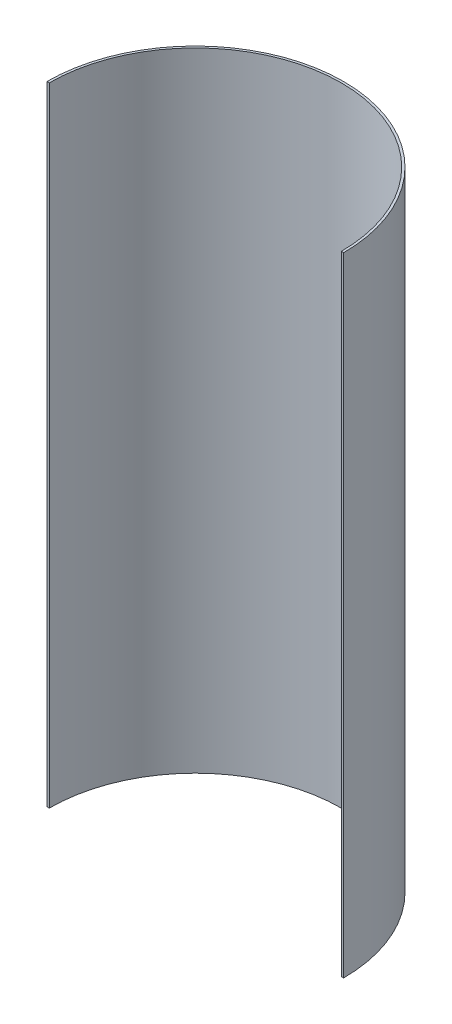
ISO-10303-21;
HEADER;
FILE_DESCRIPTION(('STEP AP214'),'2;1');
FILE_NAME('part.step','',(''),(''),'','','');
FILE_SCHEMA(('AUTOMOTIVE_DESIGN { 1 0 10303 214 1 1 1 1 }'));
ENDSEC;
DATA;
#1=APPLICATION_CONTEXT('core data for automotive mechanical design processes');
#2=APPLICATION_PROTOCOL_DEFINITION('international standard','automotive_design',2000,#1);
#3=PRODUCT_CONTEXT('',#1,'mechanical');
#4=PRODUCT('Part','Part','',(#3));
#5=PRODUCT_RELATED_PRODUCT_CATEGORY('part','',(#4));
#6=PRODUCT_DEFINITION_FORMATION('','',#4);
#7=PRODUCT_DEFINITION_CONTEXT('part definition',#1,'design');
#8=PRODUCT_DEFINITION('design','',#6,#7);
#9=PRODUCT_DEFINITION_SHAPE('','',#8);
#10=(LENGTH_UNIT() NAMED_UNIT(*) SI_UNIT(.MILLI.,.METRE.));
#11=(NAMED_UNIT(*) PLANE_ANGLE_UNIT() SI_UNIT($,.RADIAN.));
#12=(NAMED_UNIT(*) SI_UNIT($,.STERADIAN.) SOLID_ANGLE_UNIT());
#13=UNCERTAINTY_MEASURE_WITH_UNIT(LENGTH_MEASURE(1.E-05),#10,'distance_accuracy_value','');
#14=(GEOMETRIC_REPRESENTATION_CONTEXT(3) GLOBAL_UNCERTAINTY_ASSIGNED_CONTEXT((#13)) GLOBAL_UNIT_ASSIGNED_CONTEXT((#10,
#11,#12)) REPRESENTATION_CONTEXT('',''));
#15=CARTESIAN_POINT('',(0.,0.,0.));
#16=DIRECTION('',(0.,0.,1.));
#17=DIRECTION('',(1.,0.,0.));
#18=AXIS2_PLACEMENT_3D('',#15,#16,#17);
#19=CARTESIAN_POINT('',(3.15537971495114,685.8,-98.9208616283135));
#20=DIRECTION('',(0.,-1.,0.));
#21=DIRECTION('',(0.,0.,-1.));
#22=AXIS2_PLACEMENT_3D('',#19,#20,#21);
#23=CYLINDRICAL_SURFACE('',#22,159.385);
#24=CARTESIAN_POINT('',(3.15537971495114,0.,-98.9208616283135));
#25=DIRECTION('',(0.,1.,0.));
#26=DIRECTION('',(1.,0.,0.));
#27=AXIS2_PLACEMENT_3D('',#24,#25,#26);
#28=CIRCLE('',#27,159.385);
#29=CARTESIAN_POINT('',(-156.229620285049,0.,-98.9208616283135));
#30=VERTEX_POINT('',#29);
#31=CARTESIAN_POINT('',(162.540379714951,0.,-98.9208616283135));
#32=VERTEX_POINT('',#31);
#33=EDGE_CURVE('E107',#30,#32,#28,.F.);
#34=ORIENTED_EDGE('',*,*,#33,.T.);
#35=DIRECTION('',(0.,-1.,0.));
#36=VECTOR('',#35,1.);
#37=CARTESIAN_POINT('',(162.540379714951,685.8,-98.9208616283135));
#38=LINE('',#37,#36);
#39=CARTESIAN_POINT('',(162.540379714951,685.8,-98.9208616283135));
#40=VERTEX_POINT('',#39);
#41=EDGE_CURVE('E11',#40,#32,#38,.T.);
#42=ORIENTED_EDGE('',*,*,#41,.F.);
#43=CARTESIAN_POINT('',(3.15537971495114,685.8,-98.9208616283135));
#44=DIRECTION('',(0.,1.,0.));
#45=DIRECTION('',(1.,0.,0.));
#46=AXIS2_PLACEMENT_3D('',#43,#44,#45);
#47=CIRCLE('',#46,159.385);
#48=CARTESIAN_POINT('',(-156.229620285049,685.8,-98.9208616283135));
#49=VERTEX_POINT('',#48);
#50=EDGE_CURVE('E80',#49,#40,#47,.F.);
#51=ORIENTED_EDGE('',*,*,#50,.F.);
#52=DIRECTION('',(0.,-1.,0.));
#53=VECTOR('',#52,1.);
#54=CARTESIAN_POINT('',(-156.229620285049,685.8,-98.9208616283135));
#55=LINE('',#54,#53);
#56=EDGE_CURVE('E56',#49,#30,#55,.T.);
#57=ORIENTED_EDGE('',*,*,#56,.T.);
#58=EDGE_LOOP('',(#34,#42,#51,#57));
#59=FACE_BOUND('',#58,.T.);
#60=ADVANCED_FACE('F39',(#59),#23,.F.);
#61=CARTESIAN_POINT('',(165.080379714951,685.8,-98.9208616283135));
#62=DIRECTION('',(0.,0.,1.));
#63=DIRECTION('',(1.,0.,0.));
#64=AXIS2_PLACEMENT_3D('',#61,#62,#63);
#65=PLANE('',#64);
#66=DIRECTION('',(-1.,0.,0.));
#67=VECTOR('',#66,1.);
#68=CARTESIAN_POINT('',(165.080379714951,0.,-98.9208616283135));
#69=LINE('',#68,#67);
#70=CARTESIAN_POINT('',(165.080379714951,0.,-98.9208616283135));
#71=VERTEX_POINT('',#70);
#72=EDGE_CURVE('E89',#71,#32,#69,.T.);
#73=ORIENTED_EDGE('',*,*,#72,.F.);
#74=DIRECTION('',(0.,-1.,0.));
#75=VECTOR('',#74,1.);
#76=CARTESIAN_POINT('',(165.080379714951,685.8,-98.9208616283135));
#77=LINE('',#76,#75);
#78=CARTESIAN_POINT('',(165.080379714951,685.8,-98.9208616283135));
#79=VERTEX_POINT('',#78);
#80=EDGE_CURVE('E48',#79,#71,#77,.T.);
#81=ORIENTED_EDGE('',*,*,#80,.F.);
#82=DIRECTION('',(-1.,0.,0.));
#83=VECTOR('',#82,1.);
#84=CARTESIAN_POINT('',(165.080379714951,685.8,-98.9208616283135));
#85=LINE('',#84,#83);
#86=EDGE_CURVE('E87',#79,#40,#85,.T.);
#87=ORIENTED_EDGE('',*,*,#86,.T.);
#88=ORIENTED_EDGE('',*,*,#41,.T.);
#89=EDGE_LOOP('',(#73,#81,#87,#88));
#90=FACE_BOUND('',#89,.T.);
#91=ADVANCED_FACE('F86',(#90),#65,.T.);
#92=CARTESIAN_POINT('',(3.15537971495114,685.8,-98.9208616283135));
#93=DIRECTION('',(0.,-1.,0.));
#94=DIRECTION('',(0.,0.,-1.));
#95=AXIS2_PLACEMENT_3D('',#92,#93,#94);
#96=CYLINDRICAL_SURFACE('',#95,161.925);
#97=CARTESIAN_POINT('',(3.15537971495114,0.,-98.9208616283135));
#98=DIRECTION('',(0.,-1.,0.));
#99=DIRECTION('',(0.,0.,-1.));
#100=AXIS2_PLACEMENT_3D('',#97,#98,#99);
#101=CIRCLE('',#100,161.925);
#102=CARTESIAN_POINT('',(-158.769620285049,0.,-98.9208616283134));
#103=VERTEX_POINT('',#102);
#104=EDGE_CURVE('E112',#103,#71,#101,.T.);
#105=ORIENTED_EDGE('',*,*,#104,.F.);
#106=DIRECTION('',(0.,-1.,0.));
#107=VECTOR('',#106,1.);
#108=CARTESIAN_POINT('',(-158.769620285049,685.8,-98.9208616283134));
#109=LINE('',#108,#107);
#110=CARTESIAN_POINT('',(-158.769620285049,685.8,-98.9208616283134));
#111=VERTEX_POINT('',#110);
#112=EDGE_CURVE('E69',#111,#103,#109,.T.);
#113=ORIENTED_EDGE('',*,*,#112,.F.);
#114=CARTESIAN_POINT('',(3.15537971495114,685.8,-98.9208616283135));
#115=DIRECTION('',(0.,-1.,0.));
#116=DIRECTION('',(0.,0.,-1.));
#117=AXIS2_PLACEMENT_3D('',#114,#115,#116);
#118=CIRCLE('',#117,161.925);
#119=EDGE_CURVE('E96',#111,#79,#118,.T.);
#120=ORIENTED_EDGE('',*,*,#119,.T.);
#121=ORIENTED_EDGE('',*,*,#80,.T.);
#122=EDGE_LOOP('',(#105,#113,#120,#121));
#123=FACE_BOUND('',#122,.T.);
#124=ADVANCED_FACE('F99',(#123),#96,.T.);
#125=CARTESIAN_POINT('',(-156.229620285049,685.8,-98.9208616283135));
#126=DIRECTION('',(0.,0.,1.));
#127=DIRECTION('',(1.,0.,0.));
#128=AXIS2_PLACEMENT_3D('',#125,#126,#127);
#129=PLANE('',#128);
#130=DIRECTION('',(-1.,0.,0.));
#131=VECTOR('',#130,1.);
#132=CARTESIAN_POINT('',(-156.229620285049,0.,-98.9208616283135));
#133=LINE('',#132,#131);
#134=EDGE_CURVE('E115',#30,#103,#133,.T.);
#135=ORIENTED_EDGE('',*,*,#134,.F.);
#136=ORIENTED_EDGE('',*,*,#56,.F.);
#137=DIRECTION('',(-1.,0.,0.));
#138=VECTOR('',#137,1.);
#139=CARTESIAN_POINT('',(-156.229620285049,685.8,-98.9208616283135));
#140=LINE('',#139,#138);
#141=EDGE_CURVE('E101',#49,#111,#140,.T.);
#142=ORIENTED_EDGE('',*,*,#141,.T.);
#143=ORIENTED_EDGE('',*,*,#112,.T.);
#144=EDGE_LOOP('',(#135,#136,#142,#143));
#145=FACE_BOUND('',#144,.T.);
#146=ADVANCED_FACE('F125',(#145),#129,.T.);
#147=CARTESIAN_POINT('',(3.15537971495114,685.8,-98.9208616283135));
#148=DIRECTION('',(0.,1.,0.));
#149=DIRECTION('',(1.,0.,0.));
#150=AXIS2_PLACEMENT_3D('',#147,#148,#149);
#151=PLANE('',#150);
#152=ORIENTED_EDGE('',*,*,#50,.T.);
#153=ORIENTED_EDGE('',*,*,#86,.F.);
#154=ORIENTED_EDGE('',*,*,#119,.F.);
#155=ORIENTED_EDGE('',*,*,#141,.F.);
#156=EDGE_LOOP('',(#152,#153,#154,#155));
#157=FACE_BOUND('',#156,.T.);
#158=ADVANCED_FACE('F95',(#157),#151,.T.);
#159=CARTESIAN_POINT('',(3.15537971495114,0.,-98.9208616283135));
#160=DIRECTION('',(0.,1.,0.));
#161=DIRECTION('',(1.,0.,0.));
#162=AXIS2_PLACEMENT_3D('',#159,#160,#161);
#163=PLANE('',#162);
#164=ORIENTED_EDGE('',*,*,#33,.F.);
#165=ORIENTED_EDGE('',*,*,#134,.T.);
#166=ORIENTED_EDGE('',*,*,#104,.T.);
#167=ORIENTED_EDGE('',*,*,#72,.T.);
#168=EDGE_LOOP('',(#164,#165,#166,#167));
#169=FACE_BOUND('',#168,.T.);
#170=ADVANCED_FACE('F124',(#169),#163,.F.);
#171=CLOSED_SHELL('',(#60,#91,#124,#146,#158,#170));
#172=MANIFOLD_SOLID_BREP('B2',#171);
#173=ADVANCED_BREP_SHAPE_REPRESENTATION('',(#18,#172),#14);
#174=SHAPE_DEFINITION_REPRESENTATION(#9,#173);
ENDSEC;
END-ISO-10303-21;
